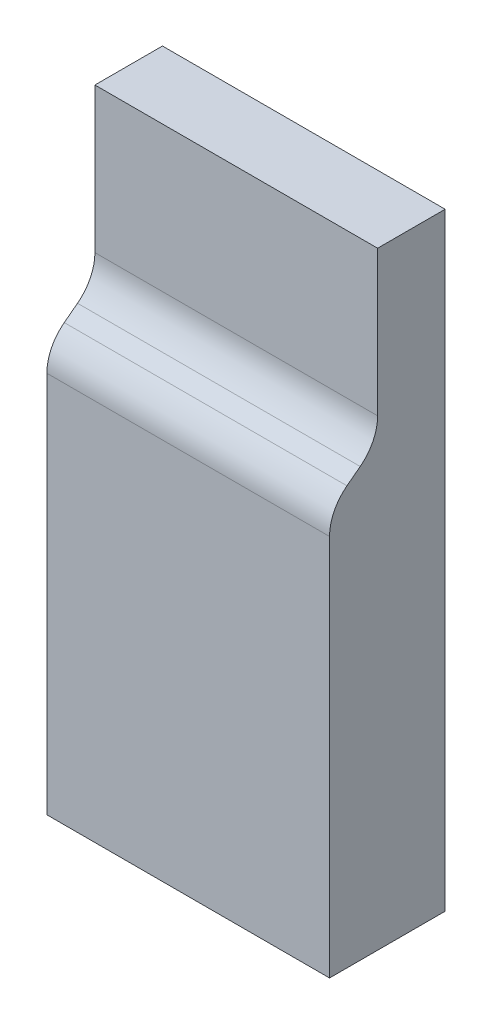
ISO-10303-21;
HEADER;
FILE_DESCRIPTION(('STEP AP214'),'2;1');
FILE_NAME('part.step','',(''),(''),'','','');
FILE_SCHEMA(('AUTOMOTIVE_DESIGN { 1 0 10303 214 1 1 1 1 }'));
ENDSEC;
DATA;
#1=APPLICATION_CONTEXT('core data for automotive mechanical design processes');
#2=APPLICATION_PROTOCOL_DEFINITION('international standard','automotive_design',2000,#1);
#3=PRODUCT_CONTEXT('',#1,'mechanical');
#4=PRODUCT('Part','Part','',(#3));
#5=PRODUCT_RELATED_PRODUCT_CATEGORY('part','',(#4));
#6=PRODUCT_DEFINITION_FORMATION('','',#4);
#7=PRODUCT_DEFINITION_CONTEXT('part definition',#1,'design');
#8=PRODUCT_DEFINITION('design','',#6,#7);
#9=PRODUCT_DEFINITION_SHAPE('','',#8);
#10=(LENGTH_UNIT() NAMED_UNIT(*) SI_UNIT(.MILLI.,.METRE.));
#11=(NAMED_UNIT(*) PLANE_ANGLE_UNIT() SI_UNIT($,.RADIAN.));
#12=(NAMED_UNIT(*) SI_UNIT($,.STERADIAN.) SOLID_ANGLE_UNIT());
#13=UNCERTAINTY_MEASURE_WITH_UNIT(LENGTH_MEASURE(1.E-05),#10,'distance_accuracy_value','');
#14=(GEOMETRIC_REPRESENTATION_CONTEXT(3) GLOBAL_UNCERTAINTY_ASSIGNED_CONTEXT((#13)) GLOBAL_UNIT_ASSIGNED_CONTEXT((#10,
#11,#12)) REPRESENTATION_CONTEXT('',''));
#15=CARTESIAN_POINT('',(0.,0.,0.));
#16=DIRECTION('',(0.,0.,1.));
#17=DIRECTION('',(1.,0.,0.));
#18=AXIS2_PLACEMENT_3D('',#15,#16,#17);
#19=CARTESIAN_POINT('',(-73.7990997532734,55.1058591516096,155.77110978578));
#20=DIRECTION('',(0.,-1.,0.));
#21=DIRECTION('',(0.,0.,-1.));
#22=AXIS2_PLACEMENT_3D('',#19,#20,#21);
#23=PLANE('',#22);
#24=DIRECTION('',(1.,0.,0.));
#25=VECTOR('',#24,1.);
#26=CARTESIAN_POINT('',(-119.50629885397,55.1058591516096,13.3828387257561));
#27=LINE('',#26,#25);
#28=CARTESIAN_POINT('',(-73.7990997532734,55.1058591516096,13.3828387257561));
#29=VERTEX_POINT('',#28);
#30=CARTESIAN_POINT('',(-17.7814574786055,55.1058591516096,13.3828387257561));
#31=VERTEX_POINT('',#30);
#32=EDGE_CURVE('E128',#29,#31,#27,.T.);
#33=ORIENTED_EDGE('',*,*,#32,.T.);
#34=DIRECTION('',(0.,0.,-1.));
#35=VECTOR('',#34,1.);
#36=CARTESIAN_POINT('',(-17.7814574786055,55.1058591516096,155.77110978578));
#37=LINE('',#36,#35);
#38=CARTESIAN_POINT('',(-17.7814574786055,55.1058591516096,0.));
#39=VERTEX_POINT('',#38);
#40=EDGE_CURVE('E152',#31,#39,#37,.T.);
#41=ORIENTED_EDGE('',*,*,#40,.T.);
#42=DIRECTION('',(-1.,0.,0.));
#43=VECTOR('',#42,1.);
#44=CARTESIAN_POINT('',(-73.7990997532734,55.1058591516096,0.));
#45=LINE('',#44,#43);
#46=CARTESIAN_POINT('',(-73.7990997532734,55.1058591516096,0.));
#47=VERTEX_POINT('',#46);
#48=EDGE_CURVE('E147',#39,#47,#45,.T.);
#49=ORIENTED_EDGE('',*,*,#48,.T.);
#50=DIRECTION('',(0.,0.,-1.));
#51=VECTOR('',#50,1.);
#52=CARTESIAN_POINT('',(-73.7990997532734,55.1058591516096,155.77110978578));
#53=LINE('',#52,#51);
#54=EDGE_CURVE('E150',#29,#47,#53,.T.);
#55=ORIENTED_EDGE('',*,*,#54,.F.);
#56=EDGE_LOOP('',(#33,#41,#49,#55));
#57=FACE_BOUND('',#56,.T.);
#58=ADVANCED_FACE('F33',(#57),#23,.F.);
#59=CARTESIAN_POINT('',(-17.7814574786055,-65.370995682656,155.77110978578));
#60=DIRECTION('',(-1.,0.,0.));
#61=DIRECTION('',(0.,0.,1.));
#62=AXIS2_PLACEMENT_3D('',#59,#60,#61);
#63=PLANE('',#62);
#64=CARTESIAN_POINT('',(-17.7814574786055,10.4021409099387,14.1448387257561));
#65=DIRECTION('',(1.,0.,0.));
#66=DIRECTION('',(0.,0.,-1.));
#67=AXIS2_PLACEMENT_3D('',#64,#65,#66);
#68=CIRCLE('',#67,8.763);
#69=CARTESIAN_POINT('',(-17.7814574786055,17.3699490683026,19.4589537478683));
#70=VERTEX_POINT('',#69);
#71=CARTESIAN_POINT('',(-17.7814574786055,10.4021409099387,22.9078387257561));
#72=VERTEX_POINT('',#71);
#73=EDGE_CURVE('E113',#70,#72,#68,.T.);
#74=ORIENTED_EDGE('',*,*,#73,.T.);
#75=DIRECTION('',(0.,-1.,0.));
#76=VECTOR('',#75,1.);
#77=CARTESIAN_POINT('',(-17.7814574786055,-65.370995682656,22.9078387257561));
#78=LINE('',#77,#76);
#79=CARTESIAN_POINT('',(-17.7814574786055,-65.370995682656,22.9078387257561));
#80=VERTEX_POINT('',#79);
#81=EDGE_CURVE('E58',#72,#80,#78,.T.);
#82=ORIENTED_EDGE('',*,*,#81,.T.);
#83=DIRECTION('',(0.,0.,-1.));
#84=VECTOR('',#83,1.);
#85=CARTESIAN_POINT('',(-17.7814574786055,-65.370995682656,155.77110978578));
#86=LINE('',#85,#84);
#87=CARTESIAN_POINT('',(-17.7814574786055,-65.370995682656,0.));
#88=VERTEX_POINT('',#87);
#89=EDGE_CURVE('E153',#80,#88,#86,.T.);
#90=ORIENTED_EDGE('',*,*,#89,.T.);
#91=DIRECTION('',(0.,1.,0.));
#92=VECTOR('',#91,1.);
#93=CARTESIAN_POINT('',(-17.7814574786055,-65.370995682656,0.));
#94=LINE('',#93,#92);
#95=EDGE_CURVE('E144',#88,#39,#94,.T.);
#96=ORIENTED_EDGE('',*,*,#95,.T.);
#97=ORIENTED_EDGE('',*,*,#40,.F.);
#98=DIRECTION('',(0.,-1.,0.));
#99=VECTOR('',#98,1.);
#100=CARTESIAN_POINT('',(-17.7814574786055,0.,13.3828387257561));
#101=LINE('',#100,#99);
#102=CARTESIAN_POINT('',(-17.7814574786055,26.3414580070616,13.3828387257561));
#103=VERTEX_POINT('',#102);
#104=EDGE_CURVE('E111',#31,#103,#101,.T.);
#105=ORIENTED_EDGE('',*,*,#104,.T.);
#106=CARTESIAN_POINT('',(-17.7814574786055,26.3414580070615,22.1458387257561));
#107=DIRECTION('',(1.,0.,0.));
#108=DIRECTION('',(0.,0.,-1.));
#109=AXIS2_PLACEMENT_3D('',#106,#107,#108);
#110=CIRCLE('',#109,8.763);
#111=CARTESIAN_POINT('',(-17.7814574786055,19.3736498486976,16.831723703644));
#112=VERTEX_POINT('',#111);
#113=EDGE_CURVE('E120',#112,#103,#110,.T.);
#114=ORIENTED_EDGE('',*,*,#113,.F.);
#115=DIRECTION('',(0.,0.60642645465162,-0.795139582148108));
#116=VECTOR('',#115,1.);
#117=CARTESIAN_POINT('',(-17.7814574786055,20.3650818816071,15.5317691150389));
#118=LINE('',#117,#116);
#119=EDGE_CURVE('E106',#70,#112,#118,.T.);
#120=ORIENTED_EDGE('',*,*,#119,.F.);
#121=EDGE_LOOP('',(#74,#82,#90,#96,#97,#105,#114,#120));
#122=FACE_BOUND('',#121,.T.);
#123=ADVANCED_FACE('F117',(#122),#63,.F.);
#124=CARTESIAN_POINT('',(-73.7990997532734,-65.370995682656,155.77110978578));
#125=DIRECTION('',(1.,0.,0.));
#126=DIRECTION('',(0.,0.,-1.));
#127=AXIS2_PLACEMENT_3D('',#124,#125,#126);
#128=PLANE('',#127);
#129=CARTESIAN_POINT('',(-73.7990997532734,10.4021409099387,14.1448387257561));
#130=DIRECTION('',(1.,0.,0.));
#131=DIRECTION('',(0.,0.,-1.));
#132=AXIS2_PLACEMENT_3D('',#129,#130,#131);
#133=CIRCLE('',#132,8.763);
#134=CARTESIAN_POINT('',(-73.7990997532734,10.4021409099387,22.9078387257561));
#135=VERTEX_POINT('',#134);
#136=CARTESIAN_POINT('',(-73.7990997532734,17.3699490683026,19.4589537478683));
#137=VERTEX_POINT('',#136);
#138=EDGE_CURVE('E50',#135,#137,#133,.F.);
#139=ORIENTED_EDGE('',*,*,#138,.T.);
#140=DIRECTION('',(0.,-0.60642645465162,0.795139582148108));
#141=VECTOR('',#140,1.);
#142=CARTESIAN_POINT('',(-73.7990997532734,20.3650818816071,15.5317691150389));
#143=LINE('',#142,#141);
#144=CARTESIAN_POINT('',(-73.7990997532734,19.3736498486976,16.831723703644));
#145=VERTEX_POINT('',#144);
#146=EDGE_CURVE('E109',#145,#137,#143,.T.);
#147=ORIENTED_EDGE('',*,*,#146,.F.);
#148=CARTESIAN_POINT('',(-73.7990997532734,26.3414580070615,22.1458387257561));
#149=DIRECTION('',(1.,0.,0.));
#150=DIRECTION('',(0.,0.,-1.));
#151=AXIS2_PLACEMENT_3D('',#148,#149,#150);
#152=CIRCLE('',#151,8.763);
#153=CARTESIAN_POINT('',(-73.7990997532734,26.3414580070615,13.3828387257561));
#154=VERTEX_POINT('',#153);
#155=EDGE_CURVE('E127',#154,#145,#152,.F.);
#156=ORIENTED_EDGE('',*,*,#155,.F.);
#157=DIRECTION('',(0.,1.,0.));
#158=VECTOR('',#157,1.);
#159=CARTESIAN_POINT('',(-73.7990997532734,0.,13.3828387257561));
#160=LINE('',#159,#158);
#161=EDGE_CURVE('E168',#154,#29,#160,.T.);
#162=ORIENTED_EDGE('',*,*,#161,.T.);
#163=ORIENTED_EDGE('',*,*,#54,.T.);
#164=DIRECTION('',(0.,-1.,0.));
#165=VECTOR('',#164,1.);
#166=CARTESIAN_POINT('',(-73.7990997532734,-65.370995682656,0.));
#167=LINE('',#166,#165);
#168=CARTESIAN_POINT('',(-73.7990997532734,-65.370995682656,0.));
#169=VERTEX_POINT('',#168);
#170=EDGE_CURVE('E135',#47,#169,#167,.T.);
#171=ORIENTED_EDGE('',*,*,#170,.T.);
#172=DIRECTION('',(0.,0.,-1.));
#173=VECTOR('',#172,1.);
#174=CARTESIAN_POINT('',(-73.7990997532734,-65.370995682656,155.77110978578));
#175=LINE('',#174,#173);
#176=CARTESIAN_POINT('',(-73.7990997532734,-65.370995682656,22.9078387257561));
#177=VERTEX_POINT('',#176);
#178=EDGE_CURVE('E37',#177,#169,#175,.T.);
#179=ORIENTED_EDGE('',*,*,#178,.F.);
#180=DIRECTION('',(0.,1.,0.));
#181=VECTOR('',#180,1.);
#182=CARTESIAN_POINT('',(-73.7990997532734,-65.370995682656,22.9078387257561));
#183=LINE('',#182,#181);
#184=EDGE_CURVE('E11',#177,#135,#183,.T.);
#185=ORIENTED_EDGE('',*,*,#184,.T.);
#186=EDGE_LOOP('',(#139,#147,#156,#162,#163,#171,#179,#185));
#187=FACE_BOUND('',#186,.T.);
#188=ADVANCED_FACE('F35',(#187),#128,.F.);
#189=CARTESIAN_POINT('',(-57.624133753255,-6.29632368199578,22.9078387257561));
#190=DIRECTION('',(0.,0.,-1.));
#191=DIRECTION('',(-1.,0.,0.));
#192=AXIS2_PLACEMENT_3D('',#189,#190,#191);
#193=PLANE('',#192);
#194=DIRECTION('',(1.,0.,0.));
#195=VECTOR('',#194,1.);
#196=CARTESIAN_POINT('',(-119.50629885397,10.4021409099387,22.9078387257561));
#197=LINE('',#196,#195);
#198=EDGE_CURVE('E115',#135,#72,#197,.T.);
#199=ORIENTED_EDGE('',*,*,#198,.F.);
#200=ORIENTED_EDGE('',*,*,#184,.F.);
#201=DIRECTION('',(-1.,0.,0.));
#202=VECTOR('',#201,1.);
#203=CARTESIAN_POINT('',(-73.7990997532734,-65.370995682656,22.9078387257561));
#204=LINE('',#203,#202);
#205=EDGE_CURVE('E42',#80,#177,#204,.T.);
#206=ORIENTED_EDGE('',*,*,#205,.F.);
#207=ORIENTED_EDGE('',*,*,#81,.F.);
#208=EDGE_LOOP('',(#199,#200,#206,#207));
#209=FACE_BOUND('',#208,.T.);
#210=ADVANCED_FACE('F179',(#209),#193,.F.);
#211=CARTESIAN_POINT('',(0.,0.,0.));
#212=DIRECTION('',(0.,0.,-1.));
#213=DIRECTION('',(-1.,0.,0.));
#214=AXIS2_PLACEMENT_3D('',#211,#212,#213);
#215=PLANE('',#214);
#216=ORIENTED_EDGE('',*,*,#170,.F.);
#217=ORIENTED_EDGE('',*,*,#48,.F.);
#218=ORIENTED_EDGE('',*,*,#95,.F.);
#219=DIRECTION('',(1.,0.,0.));
#220=VECTOR('',#219,1.);
#221=CARTESIAN_POINT('',(-73.7990997532734,-65.370995682656,0.));
#222=LINE('',#221,#220);
#223=EDGE_CURVE('E141',#169,#88,#222,.T.);
#224=ORIENTED_EDGE('',*,*,#223,.F.);
#225=EDGE_LOOP('',(#216,#217,#218,#224));
#226=FACE_BOUND('',#225,.T.);
#227=ADVANCED_FACE('F163',(#226),#215,.T.);
#228=CARTESIAN_POINT('',(-73.7990997532734,-65.370995682656,155.77110978578));
#229=DIRECTION('',(0.,1.,0.));
#230=DIRECTION('',(0.,0.,1.));
#231=AXIS2_PLACEMENT_3D('',#228,#229,#230);
#232=PLANE('',#231);
#233=ORIENTED_EDGE('',*,*,#89,.F.);
#234=ORIENTED_EDGE('',*,*,#205,.T.);
#235=ORIENTED_EDGE('',*,*,#178,.T.);
#236=ORIENTED_EDGE('',*,*,#223,.T.);
#237=EDGE_LOOP('',(#233,#234,#235,#236));
#238=FACE_BOUND('',#237,.T.);
#239=ADVANCED_FACE('F158',(#238),#232,.F.);
#240=CARTESIAN_POINT('',(-119.50629885397,10.4021409099387,14.1448387257561));
#241=DIRECTION('',(1.,0.,0.));
#242=DIRECTION('',(0.,0.,-1.));
#243=AXIS2_PLACEMENT_3D('',#240,#241,#242);
#244=CYLINDRICAL_SURFACE('',#243,8.763);
#245=ORIENTED_EDGE('',*,*,#198,.T.);
#246=ORIENTED_EDGE('',*,*,#73,.F.);
#247=DIRECTION('',(1.,0.,0.));
#248=VECTOR('',#247,1.);
#249=CARTESIAN_POINT('',(-119.50629885397,17.3699490683026,19.4589537478683));
#250=LINE('',#249,#248);
#251=EDGE_CURVE('E101',#137,#70,#250,.T.);
#252=ORIENTED_EDGE('',*,*,#251,.F.);
#253=ORIENTED_EDGE('',*,*,#138,.F.);
#254=EDGE_LOOP('',(#245,#246,#252,#253));
#255=FACE_BOUND('',#254,.T.);
#256=ADVANCED_FACE('F114',(#255),#244,.T.);
#257=CARTESIAN_POINT('',(-119.50629885397,0.,13.3828387257561));
#258=DIRECTION('',(0.,0.,1.));
#259=DIRECTION('',(1.,0.,0.));
#260=AXIS2_PLACEMENT_3D('',#257,#258,#259);
#261=PLANE('',#260);
#262=DIRECTION('',(1.,0.,0.));
#263=VECTOR('',#262,1.);
#264=CARTESIAN_POINT('',(-119.50629885397,26.3414580070616,13.3828387257561));
#265=LINE('',#264,#263);
#266=EDGE_CURVE('E131',#154,#103,#265,.T.);
#267=ORIENTED_EDGE('',*,*,#266,.T.);
#268=ORIENTED_EDGE('',*,*,#104,.F.);
#269=ORIENTED_EDGE('',*,*,#32,.F.);
#270=ORIENTED_EDGE('',*,*,#161,.F.);
#271=EDGE_LOOP('',(#267,#268,#269,#270));
#272=FACE_BOUND('',#271,.T.);
#273=ADVANCED_FACE('F172',(#272),#261,.T.);
#274=CARTESIAN_POINT('',(-119.50629885397,26.3414580070615,22.1458387257561));
#275=DIRECTION('',(1.,0.,0.));
#276=DIRECTION('',(0.,0.,-1.));
#277=AXIS2_PLACEMENT_3D('',#274,#275,#276);
#278=CYLINDRICAL_SURFACE('',#277,8.763);
#279=ORIENTED_EDGE('',*,*,#155,.T.);
#280=DIRECTION('',(1.,0.,0.));
#281=VECTOR('',#280,1.);
#282=CARTESIAN_POINT('',(-119.50629885397,19.3736498486976,16.831723703644));
#283=LINE('',#282,#281);
#284=EDGE_CURVE('E110',#145,#112,#283,.T.);
#285=ORIENTED_EDGE('',*,*,#284,.T.);
#286=ORIENTED_EDGE('',*,*,#113,.T.);
#287=ORIENTED_EDGE('',*,*,#266,.F.);
#288=EDGE_LOOP('',(#279,#285,#286,#287));
#289=FACE_BOUND('',#288,.T.);
#290=ADVANCED_FACE('F175',(#289),#278,.F.);
#291=CARTESIAN_POINT('',(-119.50629885397,20.3650818816071,15.5317691150389));
#292=DIRECTION('',(0.,-0.795139582148108,-0.60642645465162));
#293=DIRECTION('',(0.,0.60642645465162,-0.795139582148108));
#294=AXIS2_PLACEMENT_3D('',#291,#292,#293);
#295=PLANE('',#294);
#296=ORIENTED_EDGE('',*,*,#146,.T.);
#297=ORIENTED_EDGE('',*,*,#251,.T.);
#298=ORIENTED_EDGE('',*,*,#119,.T.);
#299=ORIENTED_EDGE('',*,*,#284,.F.);
#300=EDGE_LOOP('',(#296,#297,#298,#299));
#301=FACE_BOUND('',#300,.T.);
#302=ADVANCED_FACE('F103',(#301),#295,.F.);
#303=CLOSED_SHELL('',(#58,#123,#188,#210,#227,#239,#256,#273,#290,#302));
#304=MANIFOLD_SOLID_BREP('B2',#303);
#305=ADVANCED_BREP_SHAPE_REPRESENTATION('',(#18,#304),#14);
#306=SHAPE_DEFINITION_REPRESENTATION(#9,#305);
ENDSEC;
END-ISO-10303-21;
